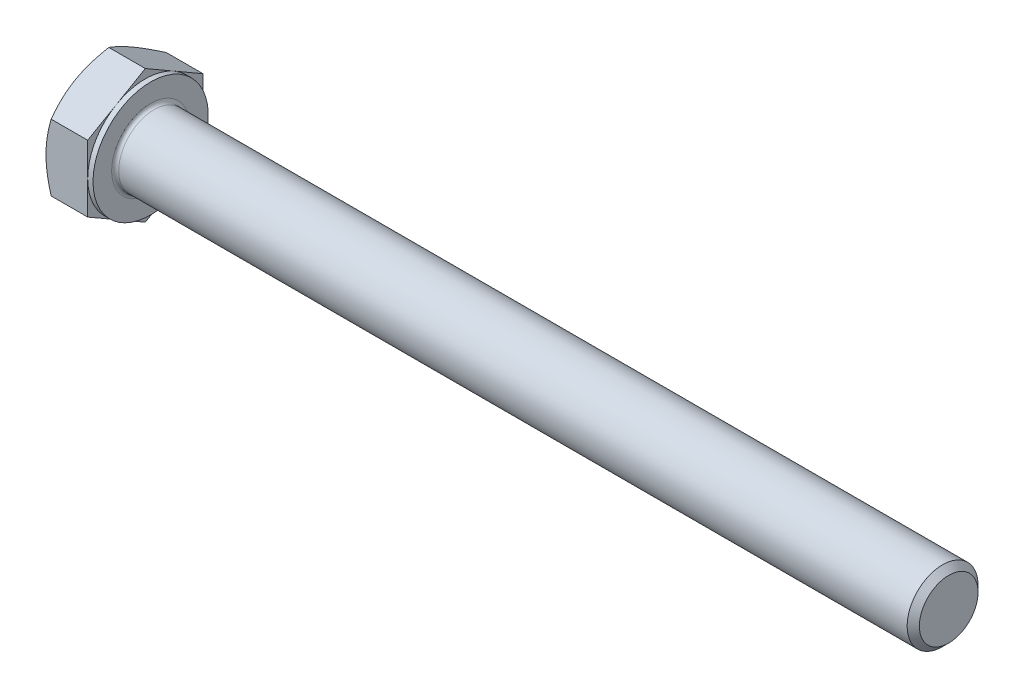
ISO-10303-21;
HEADER;
FILE_DESCRIPTION(('STEP AP214'),'2;1');
FILE_NAME('part.step','',(''),(''),'','','');
FILE_SCHEMA(('AUTOMOTIVE_DESIGN { 1 0 10303 214 1 1 1 1 }'));
ENDSEC;
DATA;
#1=APPLICATION_CONTEXT('core data for automotive mechanical design processes');
#2=APPLICATION_PROTOCOL_DEFINITION('international standard','automotive_design',2000,#1);
#3=PRODUCT_CONTEXT('',#1,'mechanical');
#4=PRODUCT('Part','Part','',(#3));
#5=PRODUCT_RELATED_PRODUCT_CATEGORY('part','',(#4));
#6=PRODUCT_DEFINITION_FORMATION('','',#4);
#7=PRODUCT_DEFINITION_CONTEXT('part definition',#1,'design');
#8=PRODUCT_DEFINITION('design','',#6,#7);
#9=PRODUCT_DEFINITION_SHAPE('','',#8);
#10=(LENGTH_UNIT() NAMED_UNIT(*) SI_UNIT(.MILLI.,.METRE.));
#11=(NAMED_UNIT(*) PLANE_ANGLE_UNIT() SI_UNIT($,.RADIAN.));
#12=(NAMED_UNIT(*) SI_UNIT($,.STERADIAN.) SOLID_ANGLE_UNIT());
#13=UNCERTAINTY_MEASURE_WITH_UNIT(LENGTH_MEASURE(1.E-05),#10,'distance_accuracy_value','');
#14=(GEOMETRIC_REPRESENTATION_CONTEXT(3) GLOBAL_UNCERTAINTY_ASSIGNED_CONTEXT((#13)) GLOBAL_UNIT_ASSIGNED_CONTEXT((#10,
#11,#12)) REPRESENTATION_CONTEXT('',''));
#15=CARTESIAN_POINT('',(0.,0.,0.));
#16=DIRECTION('',(0.,0.,1.));
#17=DIRECTION('',(1.,0.,0.));
#18=AXIS2_PLACEMENT_3D('',#15,#16,#17);
#19=CARTESIAN_POINT('',(0.,7.50555349946514,0.));
#20=DIRECTION('',(1.,0.,0.));
#21=DIRECTION('',(0.,0.,-1.));
#22=AXIS2_PLACEMENT_3D('',#19,#20,#21);
#23=PLANE('',#22);
#24=CARTESIAN_POINT('',(0.,0.,0.));
#25=DIRECTION('',(1.,0.,0.));
#26=DIRECTION('',(0.,0.,-1.));
#27=AXIS2_PLACEMENT_3D('',#24,#25,#26);
#28=CIRCLE('',#27,6.49999999995998);
#29=CARTESIAN_POINT('',(1.15549055984106E-11,-5.62916512458153,-3.24999999999));
#30=VERTEX_POINT('',#29);
#31=CARTESIAN_POINT('',(1.15519156688116E-11,0.,-6.49999999997999));
#32=VERTEX_POINT('',#31);
#33=EDGE_CURVE('E114',#30,#32,#28,.T.);
#34=ORIENTED_EDGE('',*,*,#33,.F.);
#35=CARTESIAN_POINT('',(0.,0.,0.));
#36=DIRECTION('',(1.,0.,0.));
#37=DIRECTION('',(0.,0.,-1.));
#38=AXIS2_PLACEMENT_3D('',#35,#36,#37);
#39=CIRCLE('',#38,6.49999999995998);
#40=CARTESIAN_POINT('',(1.15530270819177E-11,-5.62916512458151,3.24999999999001));
#41=VERTEX_POINT('',#40);
#42=EDGE_CURVE('E111',#41,#30,#39,.T.);
#43=ORIENTED_EDGE('',*,*,#42,.F.);
#44=CARTESIAN_POINT('',(0.,0.,0.));
#45=DIRECTION('',(1.,0.,0.));
#46=DIRECTION('',(0.,0.,-1.));
#47=AXIS2_PLACEMENT_3D('',#44,#45,#46);
#48=CIRCLE('',#47,6.49999999995998);
#49=CARTESIAN_POINT('',(1.15519866297035E-11,0.,6.49999999997999));
#50=VERTEX_POINT('',#49);
#51=EDGE_CURVE('E474',#50,#41,#48,.T.);
#52=ORIENTED_EDGE('',*,*,#51,.F.);
#53=CARTESIAN_POINT('',(0.,0.,0.));
#54=DIRECTION('',(1.,0.,0.));
#55=DIRECTION('',(0.,0.,-1.));
#56=AXIS2_PLACEMENT_3D('',#53,#54,#55);
#57=CIRCLE('',#56,6.49999999995998);
#58=CARTESIAN_POINT('',(1.15519072203646E-11,5.62916512458152,3.24999999999));
#59=VERTEX_POINT('',#58);
#60=EDGE_CURVE('E176',#59,#50,#57,.T.);
#61=ORIENTED_EDGE('',*,*,#60,.F.);
#62=CARTESIAN_POINT('',(0.,0.,0.));
#63=DIRECTION('',(1.,0.,0.));
#64=DIRECTION('',(0.,0.,-1.));
#65=AXIS2_PLACEMENT_3D('',#62,#63,#64);
#66=CIRCLE('',#65,6.49999999995998);
#67=CARTESIAN_POINT('',(1.15517194402141E-11,5.62916512458152,-3.24999999999));
#68=VERTEX_POINT('',#67);
#69=EDGE_CURVE('E472',#68,#59,#66,.T.);
#70=ORIENTED_EDGE('',*,*,#69,.F.);
#71=CARTESIAN_POINT('',(0.,0.,0.));
#72=DIRECTION('',(1.,0.,0.));
#73=DIRECTION('',(0.,0.,-1.));
#74=AXIS2_PLACEMENT_3D('',#71,#72,#73);
#75=CIRCLE('',#74,6.49999999995998);
#76=EDGE_CURVE('E117',#32,#68,#75,.T.);
#77=ORIENTED_EDGE('',*,*,#76,.F.);
#78=EDGE_LOOP('',(#34,#43,#52,#61,#70,#77));
#79=FACE_BOUND('',#78,.T.);
#80=ADVANCED_FACE('F17',(#79),#23,.F.);
#81=CARTESIAN_POINT('',(0.584039923126056,0.,0.));
#82=DIRECTION('',(1.,0.,0.));
#83=DIRECTION('',(0.,0.,-1.));
#84=AXIS2_PLACEMENT_3D('',#81,#82,#83);
#85=CONICAL_SURFACE('',#84,7.51158682049891,1.047197551212);
#86=ORIENTED_EDGE('',*,*,#42,.T.);
#87=CARTESIAN_POINT('',(2.38336895772379E-11,-5.62916512459777,-3.24999999999938));
#88=CARTESIAN_POINT('',(-2.65652344162874E-05,-5.70880728473447,-3.11205573221969));
#89=CARTESIAN_POINT('',(0.00337972763251722,-5.78844560823788,-2.97411810968284));
#90=CARTESIAN_POINT('',(0.0168605830573991,-5.94756588426562,-2.69851370708889));
#91=CARTESIAN_POINT('',(0.026933825508506,-6.02704786462283,-2.56084687882384));
#92=CARTESIAN_POINT('',(0.0534848017009942,-6.18534206384372,-2.28667328322969));
#93=CARTESIAN_POINT('',(0.0699302938009777,-6.26415564509097,-2.15016415618305));
#94=CARTESIAN_POINT('',(0.108872020464248,-6.42140731241996,-1.87779627879436));
#95=CARTESIAN_POINT('',(0.131368414291867,-6.4998453885628,-1.74193754566698));
#96=CARTESIAN_POINT('',(0.207238975555897,-6.73427122699288,-1.33590008289914));
#97=CARTESIAN_POINT('',(0.269031363386547,-6.88957797343577,-1.06690090730184));
#98=CARTESIAN_POINT('',(0.411540414604501,-7.19885589650209,-0.531215830891613));
#99=CARTESIAN_POINT('',(0.492351589092371,-7.35281628523266,-0.264548615257223));
#100=CARTESIAN_POINT('',(0.580556583603043,-7.50555349946482,-5.68587846615708E-13));
#101=B_SPLINE_CURVE_WITH_KNOTS('',3,(#87,#88,#89,#90,#91,#92,#93,#94,#95,#96,#97,#98,#99,#100),
.UNSPECIFIED.,.F.,.F.,(4,2,2,2,2,2,4),(0.,0.47780419504982,0.955513809519796,1.43083727329602,
1.90617324917161,2.85559935540238,3.80984701130895),.UNSPECIFIED.);
#102=CARTESIAN_POINT('',(0.580556583603043,-7.50555349946482,0.));
#103=VERTEX_POINT('',#102);
#104=EDGE_CURVE('E129',#30,#103,#101,.T.);
#105=ORIENTED_EDGE('',*,*,#104,.T.);
#106=CARTESIAN_POINT('',(0.580556583603043,-7.50555349946482,5.69216408040131E-13));
#107=CARTESIAN_POINT('',(0.492351589092377,-7.35281628523265,0.264548615257211));
#108=CARTESIAN_POINT('',(0.411540414604506,-7.1988558965021,0.531215830891593));
#109=CARTESIAN_POINT('',(0.26903136338655,-6.88957797343579,1.06690090730181));
#110=CARTESIAN_POINT('',(0.207238975555898,-6.7342712269929,1.33590008289911));
#111=CARTESIAN_POINT('',(0.131368414291874,-6.49984538856282,1.74193754566694));
#112=CARTESIAN_POINT('',(0.108872020464258,-6.42140731241997,1.87779627879431));
#113=CARTESIAN_POINT('',(0.0699302938009775,-6.26415564509101,2.15016415618299));
#114=CARTESIAN_POINT('',(0.0534848017009804,-6.18534206384378,2.28667328322964));
#115=CARTESIAN_POINT('',(0.0269338255085287,-6.02704786462284,2.56084687882374));
#116=CARTESIAN_POINT('',(0.016860583057472,-5.94756588426557,2.69851370708873));
#117=CARTESIAN_POINT('',(0.00337972763244816,-5.78844560823805,2.97411810968277));
#118=CARTESIAN_POINT('',(-2.6565234677579E-05,-5.70880728473494,3.11205573221977));
#119=CARTESIAN_POINT('',(2.31060541638354E-11,-5.62916512459895,3.24999999999984));
#120=B_SPLINE_CURVE_WITH_KNOTS('',3,(#106,#107,#108,#109,#110,#111,#112,#113,#114,#115,#116,
#117,#118,#119),.UNSPECIFIED.,.F.,.F.,(4,2,2,2,2,2,4),(0.,0.95424765590654,1.9036737621373,
2.37900973801287,2.85433320178907,3.33204281625901,3.80984701130877),.UNSPECIFIED.);
#121=EDGE_CURVE('E135',#103,#41,#120,.T.);
#122=ORIENTED_EDGE('',*,*,#121,.T.);
#123=EDGE_LOOP('',(#86,#105,#122));
#124=FACE_BOUND('',#123,.T.);
#125=ADVANCED_FACE('F133',(#124),#85,.T.);
#126=CARTESIAN_POINT('',(0.584039923126056,0.,0.));
#127=DIRECTION('',(1.,0.,0.));
#128=DIRECTION('',(0.,0.,-1.));
#129=AXIS2_PLACEMENT_3D('',#126,#127,#128);
#130=CONICAL_SURFACE('',#129,7.51158682049891,1.047197551212);
#131=ORIENTED_EDGE('',*,*,#33,.T.);
#132=CARTESIAN_POINT('',(2.38261518023574E-11,0.,-6.49999999999875));
#133=CARTESIAN_POINT('',(-2.65652344225189E-05,-0.159284320272008,-6.49999999999955));
#134=CARTESIAN_POINT('',(0.00337972763251153,-0.318560967278251,-6.49999999999988));
#135=CARTESIAN_POINT('',(0.0168605830573938,-0.636801519333316,-6.50000000000012));
#136=CARTESIAN_POINT('',(0.0269338255085004,-0.795765480047881,-6.50000000000003));
#137=CARTESIAN_POINT('',(0.0534848017009881,-1.11235387848978,-6.49999999999997));
#138=CARTESIAN_POINT('',(0.0699302938009714,-1.26998104098423,-6.49999999999999));
#139=CARTESIAN_POINT('',(0.108872020464242,-1.58448437564218,-6.50000000000001));
#140=CARTESIAN_POINT('',(0.131368414291862,-1.74136052792788,-6.5));
#141=CARTESIAN_POINT('',(0.207238975555892,-2.21021220478805,-6.49999999999999));
#142=CARTESIAN_POINT('',(0.269031363386541,-2.52082569767383,-6.5));
#143=CARTESIAN_POINT('',(0.411540414604495,-3.13938154380645,-6.5));
#144=CARTESIAN_POINT('',(0.492351589092366,-3.44730232126758,-6.50000000000001));
#145=CARTESIAN_POINT('',(0.580556583603038,-3.75277674973192,-6.5));
#146=B_SPLINE_CURVE_WITH_KNOTS('',3,(#132,#133,#134,#135,#136,#137,#138,#139,#140,#141,#142,
#143,#144,#145),.UNSPECIFIED.,.F.,.F.,(4,2,2,2,2,2,4),(0.,0.477804195049821,0.955513809519797,
1.43083727329602,1.90617324917161,2.85559935540238,3.80984701130895),.UNSPECIFIED.);
#147=CARTESIAN_POINT('',(0.580556583603038,-3.75277674973241,-6.49999999999971));
#148=VERTEX_POINT('',#147);
#149=EDGE_CURVE('E125',#32,#148,#146,.T.);
#150=ORIENTED_EDGE('',*,*,#149,.T.);
#151=CARTESIAN_POINT('',(0.580556583603038,-3.75277674973291,-6.49999999999943));
#152=CARTESIAN_POINT('',(0.492351589092373,-3.90551396396507,-6.23545138474279));
#153=CARTESIAN_POINT('',(0.411540414604504,-4.05947435269563,-5.96878416910841));
#154=CARTESIAN_POINT('',(0.26903136338655,-4.36875227576193,-5.4330990926982));
#155=CARTESIAN_POINT('',(0.207238975555899,-4.52405902220482,-5.1640999171009));
#156=CARTESIAN_POINT('',(0.131368414291876,-4.7584848606349,-4.75806245433307));
#157=CARTESIAN_POINT('',(0.10887202046426,-4.83692293677774,-4.62220372120571));
#158=CARTESIAN_POINT('',(0.0699302938009806,-4.9941746041067,-4.34983584381702));
#159=CARTESIAN_POINT('',(0.0534848017009838,-5.07298818535393,-4.21332671677038));
#160=CARTESIAN_POINT('',(0.0269338255085325,-5.23128238457486,-3.93915312117628));
#161=CARTESIAN_POINT('',(0.0168605830574759,-5.31076436493214,-3.80148629291129));
#162=CARTESIAN_POINT('',(0.00337972763245229,-5.46988464095965,-3.52588189031725));
#163=CARTESIAN_POINT('',(-2.65652346734909E-05,-5.54952296446276,-3.38794426778026));
#164=CARTESIAN_POINT('',(2.31098111968212E-11,-5.62916512459875,-3.25000000000019));
#165=B_SPLINE_CURVE_WITH_KNOTS('',3,(#151,#152,#153,#154,#155,#156,#157,#158,#159,#160,#161,
#162,#163,#164),.UNSPECIFIED.,.F.,.F.,(4,2,2,2,2,2,4),(0.,0.954247655906532,1.90367376213729,
2.37900973801285,2.85433320178905,3.33204281625898,3.80984701130874),.UNSPECIFIED.);
#166=EDGE_CURVE('E123',#148,#30,#165,.T.);
#167=ORIENTED_EDGE('',*,*,#166,.T.);
#168=EDGE_LOOP('',(#131,#150,#167));
#169=FACE_BOUND('',#168,.T.);
#170=ADVANCED_FACE('F124',(#169),#130,.T.);
#171=CARTESIAN_POINT('',(0.584039923126056,0.,0.));
#172=DIRECTION('',(1.,0.,0.));
#173=DIRECTION('',(0.,0.,-1.));
#174=AXIS2_PLACEMENT_3D('',#171,#172,#173);
#175=CONICAL_SURFACE('',#174,7.51158682049891,1.047197551212);
#176=CARTESIAN_POINT('',(0.580556583603033,3.7527767497319,-6.5));
#177=CARTESIAN_POINT('',(0.492351589092368,3.44730232126758,-6.5));
#178=CARTESIAN_POINT('',(0.411540414604499,3.13938154380646,-6.5));
#179=CARTESIAN_POINT('',(0.269031363386544,2.52082569767386,-6.5));
#180=CARTESIAN_POINT('',(0.207238975555893,2.21021220478808,-6.5));
#181=CARTESIAN_POINT('',(0.13136841429187,1.74136052792792,-6.5));
#182=CARTESIAN_POINT('',(0.108872020464254,1.58448437564224,-6.5));
#183=CARTESIAN_POINT('',(0.0699302938009746,1.26998104098431,-6.5));
#184=CARTESIAN_POINT('',(0.0534848017009777,1.11235387848986,-6.5));
#185=CARTESIAN_POINT('',(0.0269338255085263,0.795765480047986,-6.5));
#186=CARTESIAN_POINT('',(0.0168605830574696,0.636801519333434,-6.5));
#187=CARTESIAN_POINT('',(0.00337972763244596,0.318560967278407,-6.5));
#188=CARTESIAN_POINT('',(-2.65652346797337E-05,0.159284320272187,-6.5));
#189=CARTESIAN_POINT('',(2.31038313376231E-11,2.07834521898389E-13,-6.5));
#190=B_SPLINE_CURVE_WITH_KNOTS('',3,(#176,#177,#178,#179,#180,#181,#182,#183,#184,#185,#186,
#187,#188,#189),.UNSPECIFIED.,.F.,.F.,(4,2,2,2,2,2,4),(0.,0.954247655906532,1.90367376213729,
2.37900973801285,2.85433320178905,3.33204281625898,3.80984701130874),.UNSPECIFIED.);
#191=CARTESIAN_POINT('',(0.580556583603033,3.7527767497324,-6.49999999999971));
#192=VERTEX_POINT('',#191);
#193=EDGE_CURVE('E143',#192,#32,#190,.T.);
#194=ORIENTED_EDGE('',*,*,#193,.T.);
#195=ORIENTED_EDGE('',*,*,#76,.T.);
#196=CARTESIAN_POINT('',(2.38258913852585E-11,5.62916512459776,-3.24999999999938));
#197=CARTESIAN_POINT('',(-2.65652344229074E-05,5.54952296446245,-3.38794426777988));
#198=CARTESIAN_POINT('',(0.00337972763251109,5.46988464095962,-3.52588189031705));
#199=CARTESIAN_POINT('',(0.0168605830573933,5.31076436493229,-3.80148629291124));
#200=CARTESIAN_POINT('',(0.0269338255084999,5.23128238457493,-3.9391531211762));
#201=CARTESIAN_POINT('',(0.0534848017009876,5.07298818535393,-4.21332671677028));
#202=CARTESIAN_POINT('',(0.0699302938009709,4.99417460410672,-4.34983584381695));
#203=CARTESIAN_POINT('',(0.108872020464241,4.83692293677777,-4.62220372120566));
#204=CARTESIAN_POINT('',(0.13136841429186,4.75848486063491,-4.75806245433303));
#205=CARTESIAN_POINT('',(0.207238975555889,4.52405902220482,-5.16409991710086));
#206=CARTESIAN_POINT('',(0.269031363386538,4.36875227576193,-5.43309909269816));
#207=CARTESIAN_POINT('',(0.411540414604492,4.05947435269562,-5.96878416910839));
#208=CARTESIAN_POINT('',(0.492351589092362,3.90551396396506,-6.23545138474278));
#209=CARTESIAN_POINT('',(0.580556583603033,3.75277674973289,-6.49999999999943));
#210=B_SPLINE_CURVE_WITH_KNOTS('',3,(#196,#197,#198,#199,#200,#201,#202,#203,#204,#205,#206,
#207,#208,#209),.UNSPECIFIED.,.F.,.F.,(4,2,2,2,2,2,4),(0.,0.477804195049819,0.955513809519792,
1.43083727329602,1.90617324917161,2.85559935540237,3.80984701130894),.UNSPECIFIED.);
#211=EDGE_CURVE('E259',#68,#192,#210,.T.);
#212=ORIENTED_EDGE('',*,*,#211,.T.);
#213=EDGE_LOOP('',(#194,#195,#212));
#214=FACE_BOUND('',#213,.T.);
#215=ADVANCED_FACE('F248',(#214),#175,.T.);
#216=CARTESIAN_POINT('',(0.584039923126056,0.,0.));
#217=DIRECTION('',(1.,0.,0.));
#218=DIRECTION('',(0.,0.,-1.));
#219=AXIS2_PLACEMENT_3D('',#216,#217,#218);
#220=CONICAL_SURFACE('',#219,7.51158682049891,1.047197551212);
#221=CARTESIAN_POINT('',(0.580556583603038,7.50555349946481,-5.68103519030132E-13));
#222=CARTESIAN_POINT('',(0.492351589092373,7.35281628523265,-0.264548615257209));
#223=CARTESIAN_POINT('',(0.411540414604503,7.19885589650209,-0.53121583089159));
#224=CARTESIAN_POINT('',(0.269031363386547,6.88957797343579,-1.06690090730181));
#225=CARTESIAN_POINT('',(0.207238975555896,6.7342712269929,-1.33590008289911));
#226=CARTESIAN_POINT('',(0.131368414291872,6.49984538856282,-1.74193754566694));
#227=CARTESIAN_POINT('',(0.108872020464256,6.42140731241997,-1.8777962787943));
#228=CARTESIAN_POINT('',(0.0699302938009756,6.264155645091,-2.15016415618298));
#229=CARTESIAN_POINT('',(0.0534848017009786,6.18534206384378,-2.28667328322963));
#230=CARTESIAN_POINT('',(0.0269338255085268,6.02704786462284,-2.56084687882373));
#231=CARTESIAN_POINT('',(0.0168605830574699,5.94756588426557,-2.69851370708872));
#232=CARTESIAN_POINT('',(0.00337972763244571,5.78844560823805,-2.97411810968276));
#233=CARTESIAN_POINT('',(-2.65652346801977E-05,5.70880728473494,-3.11205573221975));
#234=CARTESIAN_POINT('',(2.31033136875451E-11,5.62916512459895,-3.24999999999983));
#235=B_SPLINE_CURVE_WITH_KNOTS('',3,(#221,#222,#223,#224,#225,#226,#227,#228,#229,#230,#231,
#232,#233,#234),.UNSPECIFIED.,.F.,.F.,(4,2,2,2,2,2,4),(0.,0.954247655906536,1.9036737621373,
2.37900973801286,2.85433320178906,3.332042816259,3.80984701130876),.UNSPECIFIED.);
#236=CARTESIAN_POINT('',(0.580556583603038,7.50555349946481,0.));
#237=VERTEX_POINT('',#236);
#238=EDGE_CURVE('E253',#237,#68,#235,.T.);
#239=ORIENTED_EDGE('',*,*,#238,.T.);
#240=ORIENTED_EDGE('',*,*,#69,.T.);
#241=CARTESIAN_POINT('',(2.38253425428388E-11,5.62916512459776,3.24999999999938));
#242=CARTESIAN_POINT('',(-2.65652344235492E-05,5.70880728473446,3.11205573221969));
#243=CARTESIAN_POINT('',(0.0033797276325105,5.78844560823787,2.97411810968284));
#244=CARTESIAN_POINT('',(0.0168605830573929,5.94756588426561,2.69851370708889));
#245=CARTESIAN_POINT('',(0.0269338255084998,6.02704786462281,2.56084687882384));
#246=CARTESIAN_POINT('',(0.0534848017009879,6.18534206384371,2.28667328322969));
#247=CARTESIAN_POINT('',(0.0699302938009714,6.26415564509096,2.15016415618305));
#248=CARTESIAN_POINT('',(0.108872020464241,6.42140731241994,1.87779627879436));
#249=CARTESIAN_POINT('',(0.131368414291861,6.49984538856279,1.74193754566699));
#250=CARTESIAN_POINT('',(0.207238975555891,6.73427122699287,1.33590008289914));
#251=CARTESIAN_POINT('',(0.26903136338654,6.88957797343576,1.06690090730184));
#252=CARTESIAN_POINT('',(0.411540414604496,7.19885589650208,0.531215830891612));
#253=CARTESIAN_POINT('',(0.492351589092367,7.35281628523265,0.264548615257222));
#254=CARTESIAN_POINT('',(0.580556583603038,7.50555349946481,5.68031516550249E-13));
#255=B_SPLINE_CURVE_WITH_KNOTS('',3,(#241,#242,#243,#244,#245,#246,#247,#248,#249,#250,#251,
#252,#253,#254),.UNSPECIFIED.,.F.,.F.,(4,2,2,2,2,2,4),(0.,0.477804195049821,0.955513809519796,
1.43083727329602,1.90617324917161,2.85559935540238,3.80984701130896),.UNSPECIFIED.);
#256=EDGE_CURVE('E239',#59,#237,#255,.T.);
#257=ORIENTED_EDGE('',*,*,#256,.T.);
#258=EDGE_LOOP('',(#239,#240,#257));
#259=FACE_BOUND('',#258,.T.);
#260=ADVANCED_FACE('F245',(#259),#220,.T.);
#261=CARTESIAN_POINT('',(0.584039923126056,0.,0.));
#262=DIRECTION('',(1.,0.,0.));
#263=DIRECTION('',(0.,0.,-1.));
#264=AXIS2_PLACEMENT_3D('',#261,#262,#263);
#265=CONICAL_SURFACE('',#264,7.51158682049891,1.047197551212);
#266=ORIENTED_EDGE('',*,*,#51,.T.);
#267=CARTESIAN_POINT('',(2.38287324809626E-11,-5.62916512459776,3.24999999999939));
#268=CARTESIAN_POINT('',(-2.65652344204729E-05,-5.54952296446245,3.38794426777989));
#269=CARTESIAN_POINT('',(0.00337972763251341,-5.46988464095962,3.52588189031706));
#270=CARTESIAN_POINT('',(0.0168605830573956,-5.31076436493229,3.80148629291125));
#271=CARTESIAN_POINT('',(0.0269338255085023,-5.23128238457493,3.93915312117621));
#272=CARTESIAN_POINT('',(0.0534848017009899,-5.07298818535393,4.21332671677029));
#273=CARTESIAN_POINT('',(0.069930293800973,-4.99417460410672,4.34983584381696));
#274=CARTESIAN_POINT('',(0.108872020464243,-4.83692293677776,4.62220372120566));
#275=CARTESIAN_POINT('',(0.131368414291863,-4.75848486063491,4.75806245433303));
#276=CARTESIAN_POINT('',(0.207238975555893,-4.52405902220482,5.16409991710086));
#277=CARTESIAN_POINT('',(0.269031363386541,-4.36875227576193,5.43309909269817));
#278=CARTESIAN_POINT('',(0.411540414604493,-4.05947435269562,5.9687841691084));
#279=CARTESIAN_POINT('',(0.492351589092362,-3.90551396396506,6.23545138474279));
#280=CARTESIAN_POINT('',(0.580556583603034,-3.75277674973289,6.49999999999943));
#281=B_SPLINE_CURVE_WITH_KNOTS('',3,(#267,#268,#269,#270,#271,#272,#273,#274,#275,#276,#277,
#278,#279,#280),.UNSPECIFIED.,.F.,.F.,(4,2,2,2,2,2,4),(0.,0.477804195049817,0.95551380951979,
1.43083727329601,1.9061732491716,2.85559935540236,3.80984701130893),.UNSPECIFIED.);
#282=CARTESIAN_POINT('',(0.580556583603129,-3.75277674973272,6.49999999999972));
#283=VERTEX_POINT('',#282);
#284=EDGE_CURVE('E130',#41,#283,#281,.T.);
#285=ORIENTED_EDGE('',*,*,#284,.T.);
#286=CARTESIAN_POINT('',(0.580556583603034,-3.7527767497319,6.5));
#287=CARTESIAN_POINT('',(0.492351589092369,-3.44730232126758,6.5));
#288=CARTESIAN_POINT('',(0.4115404146045,-3.13938154380646,6.5));
#289=CARTESIAN_POINT('',(0.269031363386544,-2.52082569767386,6.5));
#290=CARTESIAN_POINT('',(0.207238975555893,-2.21021220478808,6.5));
#291=CARTESIAN_POINT('',(0.131368414291871,-1.74136052792792,6.5));
#292=CARTESIAN_POINT('',(0.108872020464255,-1.58448437564224,6.5));
#293=CARTESIAN_POINT('',(0.0699302938009752,-1.26998104098431,6.5));
#294=CARTESIAN_POINT('',(0.0534848017009778,-1.11235387848986,6.5));
#295=CARTESIAN_POINT('',(0.0269338255085262,-0.795765480047986,6.5));
#296=CARTESIAN_POINT('',(0.0168605830574699,-0.636801519333433,6.5));
#297=CARTESIAN_POINT('',(0.00337972763244671,-0.318560967278406,6.5));
#298=CARTESIAN_POINT('',(-2.65652346789332E-05,-0.159284320272186,6.5));
#299=CARTESIAN_POINT('',(2.31038480665239E-11,-2.07418814009542E-13,6.5));
#300=B_SPLINE_CURVE_WITH_KNOTS('',3,(#286,#287,#288,#289,#290,#291,#292,#293,#294,#295,#296,
#297,#298,#299),.UNSPECIFIED.,.F.,.F.,(4,2,2,2,2,2,4),(0.,0.954247655906533,1.90367376213729,
2.37900973801285,2.85433320178905,3.33204281625898,3.80984701130875),.UNSPECIFIED.);
#301=EDGE_CURVE('E216',#283,#50,#300,.T.);
#302=ORIENTED_EDGE('',*,*,#301,.T.);
#303=EDGE_LOOP('',(#266,#285,#302));
#304=FACE_BOUND('',#303,.T.);
#305=ADVANCED_FACE('F192',(#304),#265,.T.);
#306=CARTESIAN_POINT('',(0.584039923126056,0.,0.));
#307=DIRECTION('',(1.,0.,0.));
#308=DIRECTION('',(0.,0.,-1.));
#309=AXIS2_PLACEMENT_3D('',#306,#307,#308);
#310=CONICAL_SURFACE('',#309,7.51158682049891,1.047197551212);
#311=CARTESIAN_POINT('',(0.580556583603033,3.75277674973289,6.49999999999943));
#312=CARTESIAN_POINT('',(0.492351589092368,3.90551396396505,6.23545138474279));
#313=CARTESIAN_POINT('',(0.411540414604499,4.05947435269561,5.96878416910841));
#314=CARTESIAN_POINT('',(0.269031363386545,4.36875227576191,5.4330990926982));
#315=CARTESIAN_POINT('',(0.207238975555894,4.5240590222048,5.1640999171009));
#316=CARTESIAN_POINT('',(0.13136841429187,4.75848486063488,4.75806245433307));
#317=CARTESIAN_POINT('',(0.108872020464254,4.83692293677772,4.62220372120571));
#318=CARTESIAN_POINT('',(0.0699302938009745,4.99417460410669,4.34983584381702));
#319=CARTESIAN_POINT('',(0.0534848017009776,5.07298818535391,4.21332671677038));
#320=CARTESIAN_POINT('',(0.0269338255085262,5.23128238457485,3.93915312117628));
#321=CARTESIAN_POINT('',(0.0168605830574696,5.31076436493213,3.80148629291129));
#322=CARTESIAN_POINT('',(0.00337972763244603,5.46988464095964,3.52588189031725));
#323=CARTESIAN_POINT('',(-2.65652346796775E-05,5.54952296446275,3.38794426778026));
#324=CARTESIAN_POINT('',(2.31038144407292E-11,5.62916512459874,3.25000000000019));
#325=B_SPLINE_CURVE_WITH_KNOTS('',3,(#311,#312,#313,#314,#315,#316,#317,#318,#319,#320,#321,
#322,#323,#324),.UNSPECIFIED.,.F.,.F.,(4,2,2,2,2,2,4),(0.,0.954247655906531,1.90367376213729,
2.37900973801285,2.85433320178905,3.33204281625898,3.80984701130874),.UNSPECIFIED.);
#326=CARTESIAN_POINT('',(0.580556583603033,3.7527767497324,6.49999999999971));
#327=VERTEX_POINT('',#326);
#328=EDGE_CURVE('E198',#327,#59,#325,.T.);
#329=ORIENTED_EDGE('',*,*,#328,.T.);
#330=ORIENTED_EDGE('',*,*,#60,.T.);
#331=CARTESIAN_POINT('',(2.38257762237078E-11,0.,6.49999999999875));
#332=CARTESIAN_POINT('',(-2.65652344229695E-05,0.159284320272008,6.49999999999955));
#333=CARTESIAN_POINT('',(0.00337972763251101,0.318560967278251,6.49999999999988));
#334=CARTESIAN_POINT('',(0.0168605830573932,0.636801519333313,6.50000000000012));
#335=CARTESIAN_POINT('',(0.0269338255084998,0.795765480047878,6.50000000000003));
#336=CARTESIAN_POINT('',(0.0534848017009875,1.11235387848977,6.49999999999997));
#337=CARTESIAN_POINT('',(0.0699302938009709,1.26998104098423,6.49999999999999));
#338=CARTESIAN_POINT('',(0.108872020464241,1.58448437564217,6.50000000000001));
#339=CARTESIAN_POINT('',(0.13136841429186,1.74136052792787,6.5));
#340=CARTESIAN_POINT('',(0.20723897555589,2.21021220478804,6.49999999999999));
#341=CARTESIAN_POINT('',(0.269031363386538,2.52082569767382,6.5));
#342=CARTESIAN_POINT('',(0.411540414604492,3.13938154380644,6.5));
#343=CARTESIAN_POINT('',(0.492351589092362,3.44730232126756,6.50000000000001));
#344=CARTESIAN_POINT('',(0.580556583603033,3.7527767497319,6.5));
#345=B_SPLINE_CURVE_WITH_KNOTS('',3,(#331,#332,#333,#334,#335,#336,#337,#338,#339,#340,#341,
#342,#343,#344),.UNSPECIFIED.,.F.,.F.,(4,2,2,2,2,2,4),(0.,0.477804195049818,0.955513809519792,
1.43083727329602,1.9061732491716,2.85559935540237,3.80984701130894),.UNSPECIFIED.);
#346=EDGE_CURVE('E207',#50,#327,#345,.T.);
#347=ORIENTED_EDGE('',*,*,#346,.T.);
#348=EDGE_LOOP('',(#329,#330,#347));
#349=FACE_BOUND('',#348,.T.);
#350=ADVANCED_FACE('F187',(#349),#310,.T.);
#351=CARTESIAN_POINT('',(5.3,-7.50555349946515,0.));
#352=DIRECTION('',(0.,0.866025403784438,-0.500000000000002));
#353=DIRECTION('',(0.,0.500000000000002,0.866025403784438));
#354=AXIS2_PLACEMENT_3D('',#351,#352,#353);
#355=PLANE('',#354);
#356=DIRECTION('',(1.,0.,0.));
#357=VECTOR('',#356,1.);
#358=CARTESIAN_POINT('',(5.3,-3.75277674973256,6.5));
#359=LINE('',#358,#357);
#360=CARTESIAN_POINT('',(4.7,-3.75277674973256,6.5));
#361=VERTEX_POINT('',#360);
#362=EDGE_CURVE('E398',#361,#283,#359,.F.);
#363=ORIENTED_EDGE('',*,*,#362,.T.);
#364=ORIENTED_EDGE('',*,*,#284,.F.);
#365=ORIENTED_EDGE('',*,*,#121,.F.);
#366=DIRECTION('',(1.,0.,0.));
#367=VECTOR('',#366,1.);
#368=CARTESIAN_POINT('',(5.3,-7.50555349946515,0.));
#369=LINE('',#368,#367);
#370=CARTESIAN_POINT('',(4.7,-7.50555349946515,0.));
#371=VERTEX_POINT('',#370);
#372=EDGE_CURVE('E141',#103,#371,#369,.T.);
#373=ORIENTED_EDGE('',*,*,#372,.T.);
#374=DIRECTION('',(0.,-0.500000000000003,-0.866025403784437));
#375=VECTOR('',#374,1.);
#376=CARTESIAN_POINT('',(4.7,-5.62916512459884,3.25000000000001));
#377=LINE('',#376,#375);
#378=CARTESIAN_POINT('',(4.7,-5.62916512459884,3.25000000000001));
#379=VERTEX_POINT('',#378);
#380=EDGE_CURVE('E378',#379,#371,#377,.T.);
#381=ORIENTED_EDGE('',*,*,#380,.F.);
#382=DIRECTION('',(0.,-0.500000000000001,-0.866025403784438));
#383=VECTOR('',#382,1.);
#384=CARTESIAN_POINT('',(4.7,-3.75277674973256,6.5));
#385=LINE('',#384,#383);
#386=EDGE_CURVE('E383',#361,#379,#385,.T.);
#387=ORIENTED_EDGE('',*,*,#386,.F.);
#388=EDGE_LOOP('',(#363,#364,#365,#373,#381,#387));
#389=FACE_BOUND('',#388,.T.);
#390=ADVANCED_FACE('F183',(#389),#355,.F.);
#391=CARTESIAN_POINT('',(5.3,-3.75277674973258,-6.5));
#392=DIRECTION('',(0.,0.866025403784438,0.5));
#393=DIRECTION('',(0.,-0.5,0.866025403784438));
#394=AXIS2_PLACEMENT_3D('',#391,#392,#393);
#395=PLANE('',#394);
#396=ORIENTED_EDGE('',*,*,#372,.F.);
#397=ORIENTED_EDGE('',*,*,#104,.F.);
#398=ORIENTED_EDGE('',*,*,#166,.F.);
#399=DIRECTION('',(1.,0.,0.));
#400=VECTOR('',#399,1.);
#401=CARTESIAN_POINT('',(5.3,-3.75277674973258,-6.5));
#402=LINE('',#401,#400);
#403=CARTESIAN_POINT('',(4.7,-3.75277674973258,-6.5));
#404=VERTEX_POINT('',#403);
#405=EDGE_CURVE('E260',#148,#404,#402,.T.);
#406=ORIENTED_EDGE('',*,*,#405,.T.);
#407=DIRECTION('',(0.,0.499999999999998,-0.86602540378444));
#408=VECTOR('',#407,1.);
#409=CARTESIAN_POINT('',(4.7,-5.62916512459885,-3.25));
#410=LINE('',#409,#408);
#411=CARTESIAN_POINT('',(4.7,-5.62916512459885,-3.25));
#412=VERTEX_POINT('',#411);
#413=EDGE_CURVE('E368',#412,#404,#410,.T.);
#414=ORIENTED_EDGE('',*,*,#413,.F.);
#415=DIRECTION('',(0.,0.500000000000003,-0.866025403784437));
#416=VECTOR('',#415,1.);
#417=CARTESIAN_POINT('',(4.7,-7.50555349946515,0.));
#418=LINE('',#417,#416);
#419=EDGE_CURVE('E373',#371,#412,#418,.T.);
#420=ORIENTED_EDGE('',*,*,#419,.F.);
#421=EDGE_LOOP('',(#396,#397,#398,#406,#414,#420));
#422=FACE_BOUND('',#421,.T.);
#423=ADVANCED_FACE('F139',(#422),#395,.F.);
#424=CARTESIAN_POINT('',(5.3,3.75277674973256,-6.5));
#425=DIRECTION('',(0.,0.,1.));
#426=DIRECTION('',(0.,-1.,0.));
#427=AXIS2_PLACEMENT_3D('',#424,#425,#426);
#428=PLANE('',#427);
#429=ORIENTED_EDGE('',*,*,#405,.F.);
#430=ORIENTED_EDGE('',*,*,#149,.F.);
#431=ORIENTED_EDGE('',*,*,#193,.F.);
#432=DIRECTION('',(1.,0.,0.));
#433=VECTOR('',#432,1.);
#434=CARTESIAN_POINT('',(5.3,3.75277674973256,-6.5));
#435=LINE('',#434,#433);
#436=CARTESIAN_POINT('',(4.7,3.75277674973256,-6.5));
#437=VERTEX_POINT('',#436);
#438=EDGE_CURVE('E406',#192,#437,#435,.T.);
#439=ORIENTED_EDGE('',*,*,#438,.T.);
#440=DIRECTION('',(0.,1.,0.));
#441=VECTOR('',#440,1.);
#442=CARTESIAN_POINT('',(4.7,6.5,-6.5));
#443=LINE('',#442,#441);
#444=CARTESIAN_POINT('',(4.7,0.,-6.5));
#445=VERTEX_POINT('',#444);
#446=EDGE_CURVE('E353',#445,#437,#443,.T.);
#447=ORIENTED_EDGE('',*,*,#446,.F.);
#448=DIRECTION('',(0.,1.,0.));
#449=VECTOR('',#448,1.);
#450=CARTESIAN_POINT('',(4.7,6.5,-6.5));
#451=LINE('',#450,#449);
#452=EDGE_CURVE('E363',#404,#445,#451,.T.);
#453=ORIENTED_EDGE('',*,*,#452,.F.);
#454=EDGE_LOOP('',(#429,#430,#431,#439,#447,#453));
#455=FACE_BOUND('',#454,.T.);
#456=ADVANCED_FACE('F269',(#455),#428,.F.);
#457=CARTESIAN_POINT('',(5.3,3.75277674973256,-6.5));
#458=DIRECTION('',(0.,-0.866025403784438,0.500000000000001));
#459=DIRECTION('',(0.,-0.500000000000001,-0.866025403784438));
#460=AXIS2_PLACEMENT_3D('',#457,#458,#459);
#461=PLANE('',#460);
#462=ORIENTED_EDGE('',*,*,#438,.F.);
#463=ORIENTED_EDGE('',*,*,#211,.F.);
#464=ORIENTED_EDGE('',*,*,#238,.F.);
#465=DIRECTION('',(1.,0.,0.));
#466=VECTOR('',#465,1.);
#467=CARTESIAN_POINT('',(5.3,7.50555349946514,0.));
#468=LINE('',#467,#466);
#469=CARTESIAN_POINT('',(4.7,7.50555349946514,0.));
#470=VERTEX_POINT('',#469);
#471=EDGE_CURVE('E244',#237,#470,#468,.T.);
#472=ORIENTED_EDGE('',*,*,#471,.T.);
#473=DIRECTION('',(0.,0.500000000000001,0.866025403784438));
#474=VECTOR('',#473,1.);
#475=CARTESIAN_POINT('',(4.7,5.62916512459885,-3.25000000000001));
#476=LINE('',#475,#474);
#477=CARTESIAN_POINT('',(4.7,5.62916512459885,-3.25000000000001));
#478=VERTEX_POINT('',#477);
#479=EDGE_CURVE('E348',#478,#470,#476,.T.);
#480=ORIENTED_EDGE('',*,*,#479,.F.);
#481=DIRECTION('',(0.,0.500000000000001,0.866025403784438));
#482=VECTOR('',#481,1.);
#483=CARTESIAN_POINT('',(4.7,3.75277674973256,-6.5));
#484=LINE('',#483,#482);
#485=EDGE_CURVE('E358',#437,#478,#484,.T.);
#486=ORIENTED_EDGE('',*,*,#485,.F.);
#487=EDGE_LOOP('',(#462,#463,#464,#472,#480,#486));
#488=FACE_BOUND('',#487,.T.);
#489=ADVANCED_FACE('F235',(#488),#461,.F.);
#490=CARTESIAN_POINT('',(5.3,7.50555349946514,0.));
#491=DIRECTION('',(0.,-0.866025403784438,-0.500000000000001));
#492=DIRECTION('',(0.,0.500000000000001,-0.866025403784438));
#493=AXIS2_PLACEMENT_3D('',#490,#491,#492);
#494=PLANE('',#493);
#495=ORIENTED_EDGE('',*,*,#471,.F.);
#496=ORIENTED_EDGE('',*,*,#256,.F.);
#497=ORIENTED_EDGE('',*,*,#328,.F.);
#498=DIRECTION('',(1.,0.,0.));
#499=VECTOR('',#498,1.);
#500=CARTESIAN_POINT('',(5.3,3.75277674973256,6.5));
#501=LINE('',#500,#499);
#502=CARTESIAN_POINT('',(4.7,3.75277674973256,6.5));
#503=VERTEX_POINT('',#502);
#504=EDGE_CURVE('E215',#327,#503,#501,.T.);
#505=ORIENTED_EDGE('',*,*,#504,.T.);
#506=DIRECTION('',(0.,-0.500000000000001,0.866025403784438));
#507=VECTOR('',#506,1.);
#508=CARTESIAN_POINT('',(4.7,5.62916512459885,3.25000000000001));
#509=LINE('',#508,#507);
#510=CARTESIAN_POINT('',(4.7,5.62916512459885,3.25000000000001));
#511=VERTEX_POINT('',#510);
#512=EDGE_CURVE('E338',#511,#503,#509,.T.);
#513=ORIENTED_EDGE('',*,*,#512,.F.);
#514=DIRECTION('',(0.,-0.500000000000001,0.866025403784438));
#515=VECTOR('',#514,1.);
#516=CARTESIAN_POINT('',(4.7,7.50555349946514,0.));
#517=LINE('',#516,#515);
#518=EDGE_CURVE('E343',#470,#511,#517,.T.);
#519=ORIENTED_EDGE('',*,*,#518,.F.);
#520=EDGE_LOOP('',(#495,#496,#497,#505,#513,#519));
#521=FACE_BOUND('',#520,.T.);
#522=ADVANCED_FACE('F228',(#521),#494,.F.);
#523=CARTESIAN_POINT('',(5.3,3.75277674973256,6.5));
#524=DIRECTION('',(0.,0.,-1.));
#525=DIRECTION('',(0.,1.,0.));
#526=AXIS2_PLACEMENT_3D('',#523,#524,#525);
#527=PLANE('',#526);
#528=ORIENTED_EDGE('',*,*,#504,.F.);
#529=ORIENTED_EDGE('',*,*,#346,.F.);
#530=ORIENTED_EDGE('',*,*,#301,.F.);
#531=ORIENTED_EDGE('',*,*,#362,.F.);
#532=DIRECTION('',(0.,1.,0.));
#533=VECTOR('',#532,1.);
#534=CARTESIAN_POINT('',(4.7,6.5,6.5));
#535=LINE('',#534,#533);
#536=CARTESIAN_POINT('',(4.7,0.,6.5));
#537=VERTEX_POINT('',#536);
#538=EDGE_CURVE('E388',#537,#361,#535,.F.);
#539=ORIENTED_EDGE('',*,*,#538,.F.);
#540=DIRECTION('',(0.,1.,0.));
#541=VECTOR('',#540,1.);
#542=CARTESIAN_POINT('',(4.7,6.5,6.5));
#543=LINE('',#542,#541);
#544=EDGE_CURVE('E330',#503,#537,#543,.F.);
#545=ORIENTED_EDGE('',*,*,#544,.F.);
#546=EDGE_LOOP('',(#528,#529,#530,#531,#539,#545));
#547=FACE_BOUND('',#546,.T.);
#548=ADVANCED_FACE('F223',(#547),#527,.F.);
#549=CARTESIAN_POINT('',(4.7,6.5,0.));
#550=DIRECTION('',(1.,0.,0.));
#551=DIRECTION('',(0.,0.,-1.));
#552=AXIS2_PLACEMENT_3D('',#549,#550,#551);
#553=PLANE('',#552);
#554=ORIENTED_EDGE('',*,*,#386,.T.);
#555=CARTESIAN_POINT('',(4.7,0.,0.));
#556=DIRECTION('',(-1.,0.,0.));
#557=DIRECTION('',(0.,0.,1.));
#558=AXIS2_PLACEMENT_3D('',#555,#556,#557);
#559=CIRCLE('',#558,6.5);
#560=EDGE_CURVE('E217',#537,#379,#559,.F.);
#561=ORIENTED_EDGE('',*,*,#560,.F.);
#562=ORIENTED_EDGE('',*,*,#538,.T.);
#563=EDGE_LOOP('',(#554,#561,#562));
#564=FACE_BOUND('',#563,.T.);
#565=ADVANCED_FACE('F227',(#564),#553,.T.);
#566=CARTESIAN_POINT('',(4.7,6.5,0.));
#567=DIRECTION('',(1.,0.,0.));
#568=DIRECTION('',(0.,0.,-1.));
#569=AXIS2_PLACEMENT_3D('',#566,#567,#568);
#570=PLANE('',#569);
#571=ORIENTED_EDGE('',*,*,#419,.T.);
#572=CARTESIAN_POINT('',(4.7,0.,0.));
#573=DIRECTION('',(-1.,0.,0.));
#574=DIRECTION('',(0.,0.,1.));
#575=AXIS2_PLACEMENT_3D('',#572,#573,#574);
#576=CIRCLE('',#575,6.5);
#577=EDGE_CURVE('E432',#379,#412,#576,.F.);
#578=ORIENTED_EDGE('',*,*,#577,.F.);
#579=ORIENTED_EDGE('',*,*,#380,.T.);
#580=EDGE_LOOP('',(#571,#578,#579));
#581=FACE_BOUND('',#580,.T.);
#582=ADVANCED_FACE('F452',(#581),#570,.T.);
#583=CARTESIAN_POINT('',(4.7,6.5,0.));
#584=DIRECTION('',(1.,0.,0.));
#585=DIRECTION('',(0.,0.,-1.));
#586=AXIS2_PLACEMENT_3D('',#583,#584,#585);
#587=PLANE('',#586);
#588=ORIENTED_EDGE('',*,*,#452,.T.);
#589=CARTESIAN_POINT('',(4.7,0.,0.));
#590=DIRECTION('',(-1.,0.,0.));
#591=DIRECTION('',(0.,0.,1.));
#592=AXIS2_PLACEMENT_3D('',#589,#590,#591);
#593=CIRCLE('',#592,6.5);
#594=EDGE_CURVE('E430',#412,#445,#593,.F.);
#595=ORIENTED_EDGE('',*,*,#594,.F.);
#596=ORIENTED_EDGE('',*,*,#413,.T.);
#597=EDGE_LOOP('',(#588,#595,#596));
#598=FACE_BOUND('',#597,.T.);
#599=ADVANCED_FACE('F455',(#598),#587,.T.);
#600=CARTESIAN_POINT('',(4.7,6.5,0.));
#601=DIRECTION('',(1.,0.,0.));
#602=DIRECTION('',(0.,0.,-1.));
#603=AXIS2_PLACEMENT_3D('',#600,#601,#602);
#604=PLANE('',#603);
#605=CARTESIAN_POINT('',(4.7,0.,0.));
#606=DIRECTION('',(-1.,0.,0.));
#607=DIRECTION('',(0.,0.,1.));
#608=AXIS2_PLACEMENT_3D('',#605,#606,#607);
#609=CIRCLE('',#608,6.5);
#610=EDGE_CURVE('E427',#445,#478,#609,.F.);
#611=ORIENTED_EDGE('',*,*,#610,.F.);
#612=ORIENTED_EDGE('',*,*,#446,.T.);
#613=ORIENTED_EDGE('',*,*,#485,.T.);
#614=EDGE_LOOP('',(#611,#612,#613));
#615=FACE_BOUND('',#614,.T.);
#616=ADVANCED_FACE('F459',(#615),#604,.T.);
#617=CARTESIAN_POINT('',(4.7,6.5,0.));
#618=DIRECTION('',(1.,0.,0.));
#619=DIRECTION('',(0.,0.,-1.));
#620=AXIS2_PLACEMENT_3D('',#617,#618,#619);
#621=PLANE('',#620);
#622=ORIENTED_EDGE('',*,*,#518,.T.);
#623=CARTESIAN_POINT('',(4.7,0.,0.));
#624=DIRECTION('',(-1.,0.,0.));
#625=DIRECTION('',(0.,0.,1.));
#626=AXIS2_PLACEMENT_3D('',#623,#624,#625);
#627=CIRCLE('',#626,6.5);
#628=EDGE_CURVE('E424',#478,#511,#627,.F.);
#629=ORIENTED_EDGE('',*,*,#628,.F.);
#630=ORIENTED_EDGE('',*,*,#479,.T.);
#631=EDGE_LOOP('',(#622,#629,#630));
#632=FACE_BOUND('',#631,.T.);
#633=ADVANCED_FACE('F464',(#632),#621,.T.);
#634=CARTESIAN_POINT('',(4.7,6.5,0.));
#635=DIRECTION('',(1.,0.,0.));
#636=DIRECTION('',(0.,0.,-1.));
#637=AXIS2_PLACEMENT_3D('',#634,#635,#636);
#638=PLANE('',#637);
#639=ORIENTED_EDGE('',*,*,#544,.T.);
#640=CARTESIAN_POINT('',(4.7,0.,0.));
#641=DIRECTION('',(-1.,0.,0.));
#642=DIRECTION('',(0.,0.,1.));
#643=AXIS2_PLACEMENT_3D('',#640,#641,#642);
#644=CIRCLE('',#643,6.5);
#645=EDGE_CURVE('E421',#511,#537,#644,.F.);
#646=ORIENTED_EDGE('',*,*,#645,.F.);
#647=ORIENTED_EDGE('',*,*,#512,.T.);
#648=EDGE_LOOP('',(#639,#646,#647));
#649=FACE_BOUND('',#648,.T.);
#650=ADVANCED_FACE('F445',(#649),#638,.T.);
#651=CARTESIAN_POINT('',(0.,0.,0.));
#652=DIRECTION('',(-1.,0.,0.));
#653=DIRECTION('',(0.,0.,1.));
#654=AXIS2_PLACEMENT_3D('',#651,#652,#653);
#655=CYLINDRICAL_SURFACE('',#654,6.5);
#656=ORIENTED_EDGE('',*,*,#594,.T.);
#657=ORIENTED_EDGE('',*,*,#610,.T.);
#658=ORIENTED_EDGE('',*,*,#628,.T.);
#659=ORIENTED_EDGE('',*,*,#645,.T.);
#660=ORIENTED_EDGE('',*,*,#560,.T.);
#661=ORIENTED_EDGE('',*,*,#577,.T.);
#662=EDGE_LOOP('',(#656,#657,#658,#659,#660,#661));
#663=FACE_BOUND('',#662,.T.);
#664=CARTESIAN_POINT('',(5.3,0.,0.));
#665=DIRECTION('',(-1.,0.,0.));
#666=DIRECTION('',(0.,0.,1.));
#667=AXIS2_PLACEMENT_3D('',#664,#665,#666);
#668=CIRCLE('',#667,6.5);
#669=CARTESIAN_POINT('',(5.3,0.,6.5));
#670=VERTEX_POINT('',#669);
#671=EDGE_CURVE('E418',#670,#670,#668,.F.);
#672=ORIENTED_EDGE('',*,*,#671,.F.);
#673=EDGE_LOOP('',(#672));
#674=FACE_BOUND('',#673,.T.);
#675=ADVANCED_FACE('F438',(#663,#674),#655,.T.);
#676=CARTESIAN_POINT('',(95.3,0.,0.));
#677=DIRECTION('',(-1.,0.,0.));
#678=DIRECTION('',(0.,0.,1.));
#679=AXIS2_PLACEMENT_3D('',#676,#677,#678);
#680=PLANE('',#679);
#681=CARTESIAN_POINT('',(95.299999999952,0.,0.));
#682=DIRECTION('',(-1.,0.,0.));
#683=DIRECTION('',(0.,0.,1.));
#684=AXIS2_PLACEMENT_3D('',#681,#682,#683);
#685=CIRCLE('',#684,3.3095000000003);
#686=CARTESIAN_POINT('',(95.299999999952,0.,3.3095000000003));
#687=VERTEX_POINT('',#686);
#688=EDGE_CURVE('E415',#687,#687,#685,.T.);
#689=ORIENTED_EDGE('',*,*,#688,.F.);
#690=EDGE_LOOP('',(#689));
#691=FACE_BOUND('',#690,.T.);
#692=ADVANCED_FACE('F314',(#691),#680,.F.);
#693=CARTESIAN_POINT('',(5.3,7.50555349946514,0.));
#694=DIRECTION('',(1.,0.,0.));
#695=DIRECTION('',(0.,0.,-1.));
#696=AXIS2_PLACEMENT_3D('',#693,#694,#695);
#697=PLANE('',#696);
#698=ORIENTED_EDGE('',*,*,#671,.T.);
#699=EDGE_LOOP('',(#698));
#700=FACE_BOUND('',#699,.T.);
#701=CARTESIAN_POINT('',(5.3,0.,0.));
#702=DIRECTION('',(1.,0.,0.));
#703=DIRECTION('',(0.,0.,1.));
#704=AXIS2_PLACEMENT_3D('',#701,#702,#703);
#705=CIRCLE('',#704,4.4);
#706=CARTESIAN_POINT('',(5.3,0.,-4.4));
#707=VERTEX_POINT('',#706);
#708=CARTESIAN_POINT('',(5.3,0.,4.4));
#709=VERTEX_POINT('',#708);
#710=EDGE_CURVE('E301',#707,#709,#705,.F.);
#711=ORIENTED_EDGE('',*,*,#710,.T.);
#712=CARTESIAN_POINT('',(5.3,0.,0.));
#713=DIRECTION('',(1.,0.,0.));
#714=DIRECTION('',(0.,0.,-1.));
#715=AXIS2_PLACEMENT_3D('',#712,#713,#714);
#716=CIRCLE('',#715,4.4);
#717=EDGE_CURVE('E36',#709,#707,#716,.F.);
#718=ORIENTED_EDGE('',*,*,#717,.T.);
#719=EDGE_LOOP('',(#711,#718));
#720=FACE_BOUND('',#719,.T.);
#721=ADVANCED_FACE('F305',(#700,#720),#697,.T.);
#722=CARTESIAN_POINT('',(94.60949999999,0.,0.));
#723=DIRECTION('',(-1.,0.,0.));
#724=DIRECTION('',(0.,0.,1.));
#725=AXIS2_PLACEMENT_3D('',#722,#723,#724);
#726=CONICAL_SURFACE('',#725,4.0000000000191,0.785398163438609);
#727=CARTESIAN_POINT('',(94.6095,0.,0.));
#728=DIRECTION('',(-1.,0.,0.));
#729=DIRECTION('',(0.,0.,1.));
#730=AXIS2_PLACEMENT_3D('',#727,#728,#729);
#731=CIRCLE('',#730,4.);
#732=CARTESIAN_POINT('',(94.6095,0.,4.));
#733=VERTEX_POINT('',#732);
#734=EDGE_CURVE('E28',#733,#733,#731,.T.);
#735=ORIENTED_EDGE('',*,*,#734,.F.);
#736=EDGE_LOOP('',(#735));
#737=FACE_BOUND('',#736,.T.);
#738=ORIENTED_EDGE('',*,*,#688,.T.);
#739=EDGE_LOOP('',(#738));
#740=FACE_BOUND('',#739,.T.);
#741=ADVANCED_FACE('F288',(#737,#740),#726,.T.);
#742=CARTESIAN_POINT('',(5.7,0.,0.));
#743=DIRECTION('',(1.,0.,0.));
#744=DIRECTION('',(0.,0.,-1.));
#745=AXIS2_PLACEMENT_3D('',#742,#743,#744);
#746=TOROIDAL_SURFACE('',#745,4.4,0.4);
#747=CARTESIAN_POINT('',(5.7,0.,0.));
#748=DIRECTION('',(-1.,0.,0.));
#749=DIRECTION('',(0.,0.,1.));
#750=AXIS2_PLACEMENT_3D('',#747,#748,#749);
#751=CIRCLE('',#750,4.);
#752=CARTESIAN_POINT('',(5.7,0.,4.));
#753=VERTEX_POINT('',#752);
#754=EDGE_CURVE('E11',#753,#753,#751,.F.);
#755=ORIENTED_EDGE('',*,*,#754,.F.);
#756=EDGE_LOOP('',(#755));
#757=FACE_BOUND('',#756,.T.);
#758=ORIENTED_EDGE('',*,*,#710,.F.);
#759=ORIENTED_EDGE('',*,*,#717,.F.);
#760=EDGE_LOOP('',(#758,#759));
#761=FACE_BOUND('',#760,.T.);
#762=ADVANCED_FACE('F282',(#757,#761),#746,.F.);
#763=CARTESIAN_POINT('',(0.,0.,0.));
#764=DIRECTION('',(-1.,0.,0.));
#765=DIRECTION('',(0.,0.,1.));
#766=AXIS2_PLACEMENT_3D('',#763,#764,#765);
#767=CYLINDRICAL_SURFACE('',#766,4.);
#768=ORIENTED_EDGE('',*,*,#754,.T.);
#769=EDGE_LOOP('',(#768));
#770=FACE_BOUND('',#769,.T.);
#771=ORIENTED_EDGE('',*,*,#734,.T.);
#772=EDGE_LOOP('',(#771));
#773=FACE_BOUND('',#772,.T.);
#774=ADVANCED_FACE('F280',(#770,#773),#767,.T.);
#775=CLOSED_SHELL('',(#80,#125,#170,#215,#260,#305,#350,#390,#423,#456,#489,#522,#548,#565,#582,
#599,#616,#633,#650,#675,#692,#721,#741,#762,#774));
#776=MANIFOLD_SOLID_BREP('B1',#775);
#777=ADVANCED_BREP_SHAPE_REPRESENTATION('',(#18,#776),#14);
#778=SHAPE_DEFINITION_REPRESENTATION(#9,#777);
ENDSEC;
END-ISO-10303-21;
